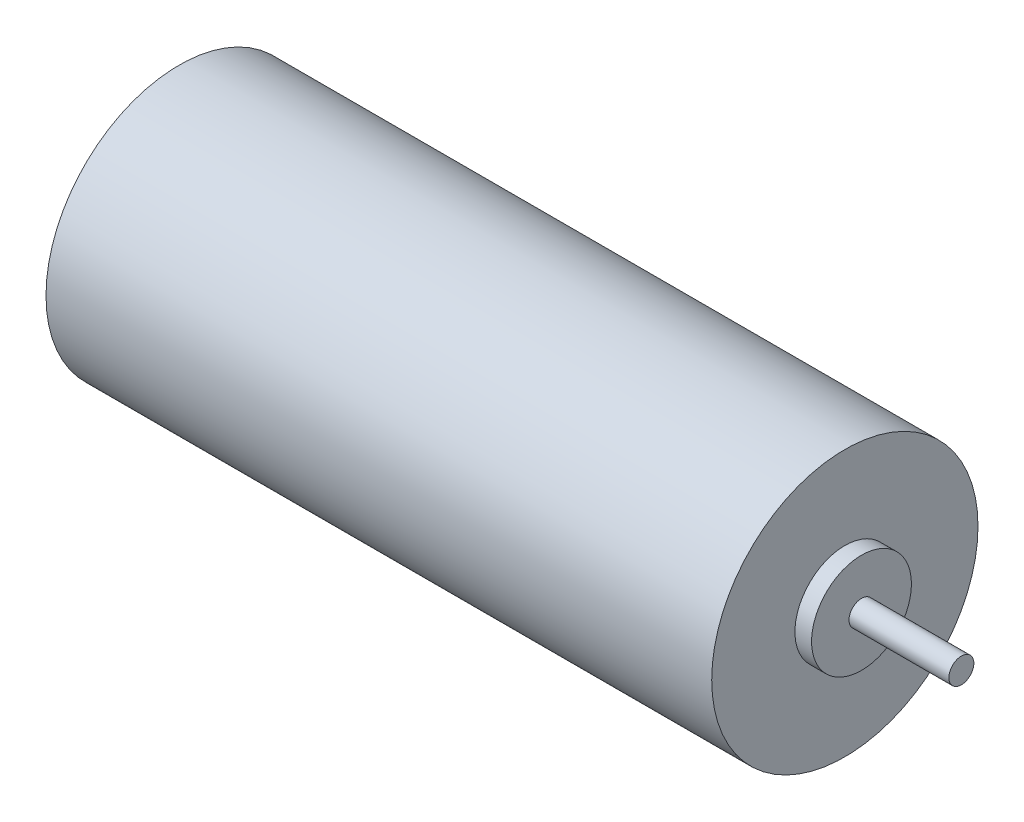
ISO-10303-21;
HEADER;
FILE_DESCRIPTION(('STEP AP214'),'2;1');
FILE_NAME('part.step','',(''),(''),'','','');
FILE_SCHEMA(('AUTOMOTIVE_DESIGN { 1 0 10303 214 1 1 1 1 }'));
ENDSEC;
DATA;
#1=APPLICATION_CONTEXT('core data for automotive mechanical design processes');
#2=APPLICATION_PROTOCOL_DEFINITION('international standard','automotive_design',2000,#1);
#3=PRODUCT_CONTEXT('',#1,'mechanical');
#4=PRODUCT('Part','Part','',(#3));
#5=PRODUCT_RELATED_PRODUCT_CATEGORY('part','',(#4));
#6=PRODUCT_DEFINITION_FORMATION('','',#4);
#7=PRODUCT_DEFINITION_CONTEXT('part definition',#1,'design');
#8=PRODUCT_DEFINITION('design','',#6,#7);
#9=PRODUCT_DEFINITION_SHAPE('','',#8);
#10=(LENGTH_UNIT() NAMED_UNIT(*) SI_UNIT(.MILLI.,.METRE.));
#11=(NAMED_UNIT(*) PLANE_ANGLE_UNIT() SI_UNIT($,.RADIAN.));
#12=(NAMED_UNIT(*) SI_UNIT($,.STERADIAN.) SOLID_ANGLE_UNIT());
#13=UNCERTAINTY_MEASURE_WITH_UNIT(LENGTH_MEASURE(1.E-05),#10,'distance_accuracy_value','');
#14=(GEOMETRIC_REPRESENTATION_CONTEXT(3) GLOBAL_UNCERTAINTY_ASSIGNED_CONTEXT((#13)) GLOBAL_UNIT_ASSIGNED_CONTEXT((#10,
#11,#12)) REPRESENTATION_CONTEXT('',''));
#15=CARTESIAN_POINT('',(0.,0.,0.));
#16=DIRECTION('',(0.,0.,1.));
#17=DIRECTION('',(1.,0.,0.));
#18=AXIS2_PLACEMENT_3D('',#15,#16,#17);
#19=CARTESIAN_POINT('',(41.,0.,0.));
#20=DIRECTION('',(1.,0.,0.));
#21=DIRECTION('',(0.,0.,-1.));
#22=AXIS2_PLACEMENT_3D('',#19,#20,#21);
#23=PLANE('',#22);
#24=CARTESIAN_POINT('',(41.,0.,0.));
#25=DIRECTION('',(1.,0.,0.));
#26=DIRECTION('',(0.,0.,-1.));
#27=AXIS2_PLACEMENT_3D('',#24,#25,#26);
#28=CIRCLE('',#27,3.);
#29=CARTESIAN_POINT('',(41.,0.,-3.));
#30=VERTEX_POINT('',#29);
#31=EDGE_CURVE('E41',#30,#30,#28,.T.);
#32=ORIENTED_EDGE('',*,*,#31,.T.);
#33=EDGE_LOOP('',(#32));
#34=FACE_BOUND('',#33,.T.);
#35=CARTESIAN_POINT('',(41.,0.,0.));
#36=DIRECTION('',(1.,0.,0.));
#37=DIRECTION('',(0.,0.,-1.));
#38=AXIS2_PLACEMENT_3D('',#35,#36,#37);
#39=CIRCLE('',#38,0.75);
#40=CARTESIAN_POINT('',(41.,0.,-0.75));
#41=VERTEX_POINT('',#40);
#42=EDGE_CURVE('E49',#41,#41,#39,.T.);
#43=ORIENTED_EDGE('',*,*,#42,.F.);
#44=EDGE_LOOP('',(#43));
#45=FACE_BOUND('',#44,.T.);
#46=ADVANCED_FACE('F30',(#34,#45),#23,.T.);
#47=CARTESIAN_POINT('',(40.,0.,0.));
#48=DIRECTION('',(1.,0.,0.));
#49=DIRECTION('',(0.,0.,-1.));
#50=AXIS2_PLACEMENT_3D('',#47,#48,#49);
#51=PLANE('',#50);
#52=CARTESIAN_POINT('',(40.,0.,0.));
#53=DIRECTION('',(1.,0.,0.));
#54=DIRECTION('',(0.,0.,-1.));
#55=AXIS2_PLACEMENT_3D('',#52,#53,#54);
#56=CIRCLE('',#55,8.);
#57=CARTESIAN_POINT('',(40.,0.,-8.));
#58=VERTEX_POINT('',#57);
#59=EDGE_CURVE('E10',#58,#58,#56,.T.);
#60=ORIENTED_EDGE('',*,*,#59,.T.);
#61=EDGE_LOOP('',(#60));
#62=FACE_BOUND('',#61,.T.);
#63=CARTESIAN_POINT('',(40.,0.,0.));
#64=DIRECTION('',(1.,0.,0.));
#65=DIRECTION('',(0.,0.,-1.));
#66=AXIS2_PLACEMENT_3D('',#63,#64,#65);
#67=CIRCLE('',#66,3.);
#68=CARTESIAN_POINT('',(40.,0.,-3.));
#69=VERTEX_POINT('',#68);
#70=EDGE_CURVE('E43',#69,#69,#67,.T.);
#71=ORIENTED_EDGE('',*,*,#70,.F.);
#72=EDGE_LOOP('',(#71));
#73=FACE_BOUND('',#72,.T.);
#74=ADVANCED_FACE('F65',(#62,#73),#51,.T.);
#75=CARTESIAN_POINT('',(40.,0.,0.));
#76=DIRECTION('',(-1.,0.,0.));
#77=DIRECTION('',(0.,0.,1.));
#78=AXIS2_PLACEMENT_3D('',#75,#76,#77);
#79=CYLINDRICAL_SURFACE('',#78,8.);
#80=ORIENTED_EDGE('',*,*,#59,.F.);
#81=EDGE_LOOP('',(#80));
#82=FACE_BOUND('',#81,.T.);
#83=CARTESIAN_POINT('',(0.,0.,0.));
#84=DIRECTION('',(1.,0.,0.));
#85=DIRECTION('',(0.,0.,-1.));
#86=AXIS2_PLACEMENT_3D('',#83,#84,#85);
#87=CIRCLE('',#86,8.);
#88=CARTESIAN_POINT('',(0.,0.,-8.));
#89=VERTEX_POINT('',#88);
#90=EDGE_CURVE('E34',#89,#89,#87,.T.);
#91=ORIENTED_EDGE('',*,*,#90,.T.);
#92=EDGE_LOOP('',(#91));
#93=FACE_BOUND('',#92,.T.);
#94=ADVANCED_FACE('F32',(#82,#93),#79,.T.);
#95=CARTESIAN_POINT('',(0.,0.,0.));
#96=DIRECTION('',(1.,0.,0.));
#97=DIRECTION('',(0.,0.,-1.));
#98=AXIS2_PLACEMENT_3D('',#95,#96,#97);
#99=PLANE('',#98);
#100=ORIENTED_EDGE('',*,*,#90,.F.);
#101=EDGE_LOOP('',(#100));
#102=FACE_BOUND('',#101,.T.);
#103=ADVANCED_FACE('F75',(#102),#99,.F.);
#104=CARTESIAN_POINT('',(41.,0.,0.));
#105=DIRECTION('',(-1.,0.,0.));
#106=DIRECTION('',(0.,0.,1.));
#107=AXIS2_PLACEMENT_3D('',#104,#105,#106);
#108=CYLINDRICAL_SURFACE('',#107,3.);
#109=ORIENTED_EDGE('',*,*,#31,.F.);
#110=EDGE_LOOP('',(#109));
#111=FACE_BOUND('',#110,.T.);
#112=ORIENTED_EDGE('',*,*,#70,.T.);
#113=EDGE_LOOP('',(#112));
#114=FACE_BOUND('',#113,.T.);
#115=ADVANCED_FACE('F60',(#111,#114),#108,.T.);
#116=CARTESIAN_POINT('',(47.,0.,0.));
#117=DIRECTION('',(-1.,0.,0.));
#118=DIRECTION('',(0.,0.,1.));
#119=AXIS2_PLACEMENT_3D('',#116,#117,#118);
#120=CYLINDRICAL_SURFACE('',#119,0.75);
#121=CARTESIAN_POINT('',(47.,0.,0.));
#122=DIRECTION('',(1.,0.,0.));
#123=DIRECTION('',(0.,0.,-1.));
#124=AXIS2_PLACEMENT_3D('',#121,#122,#123);
#125=CIRCLE('',#124,0.75);
#126=CARTESIAN_POINT('',(47.,0.,-0.75));
#127=VERTEX_POINT('',#126);
#128=EDGE_CURVE('E46',#127,#127,#125,.T.);
#129=ORIENTED_EDGE('',*,*,#128,.F.);
#130=EDGE_LOOP('',(#129));
#131=FACE_BOUND('',#130,.T.);
#132=ORIENTED_EDGE('',*,*,#42,.T.);
#133=EDGE_LOOP('',(#132));
#134=FACE_BOUND('',#133,.T.);
#135=ADVANCED_FACE('F57',(#131,#134),#120,.T.);
#136=CARTESIAN_POINT('',(47.,0.,0.));
#137=DIRECTION('',(1.,0.,0.));
#138=DIRECTION('',(0.,0.,-1.));
#139=AXIS2_PLACEMENT_3D('',#136,#137,#138);
#140=PLANE('',#139);
#141=ORIENTED_EDGE('',*,*,#128,.T.);
#142=EDGE_LOOP('',(#141));
#143=FACE_BOUND('',#142,.T.);
#144=ADVANCED_FACE('F55',(#143),#140,.T.);
#145=CLOSED_SHELL('',(#46,#74,#94,#103,#115,#135,#144));
#146=MANIFOLD_SOLID_BREP('B2',#145);
#147=ADVANCED_BREP_SHAPE_REPRESENTATION('',(#18,#146),#14);
#148=SHAPE_DEFINITION_REPRESENTATION(#9,#147);
ENDSEC;
END-ISO-10303-21;
